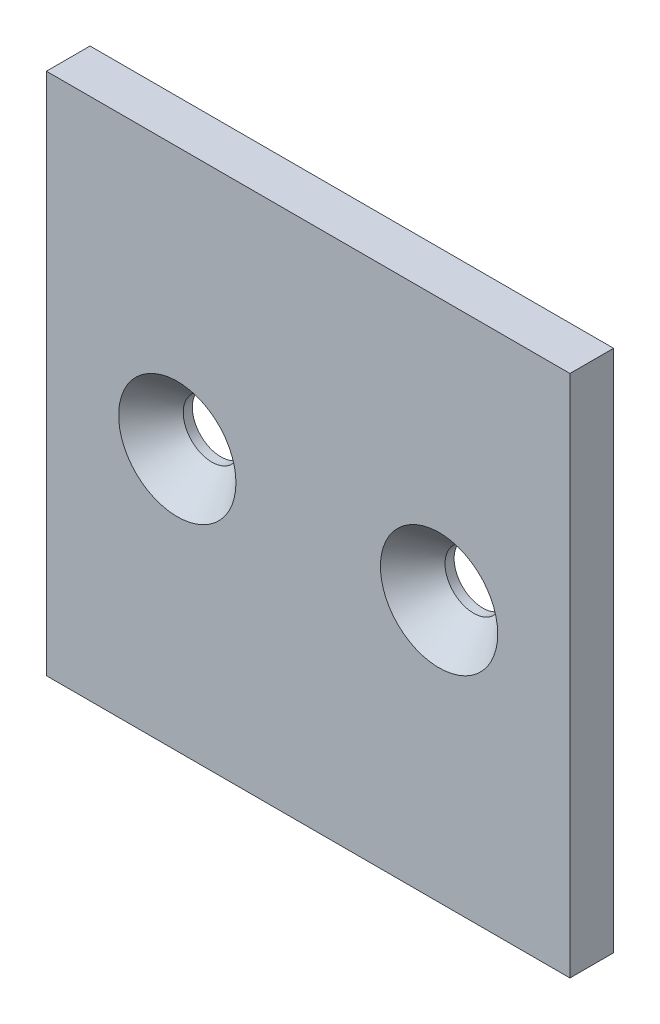
ISO-10303-21;
HEADER;
FILE_DESCRIPTION(('STEP AP214'),'2;1');
FILE_NAME('part.step','',(''),(''),'','','');
FILE_SCHEMA(('AUTOMOTIVE_DESIGN { 1 0 10303 214 1 1 1 1 }'));
ENDSEC;
DATA;
#1=APPLICATION_CONTEXT('core data for automotive mechanical design processes');
#2=APPLICATION_PROTOCOL_DEFINITION('international standard','automotive_design',2000,#1);
#3=PRODUCT_CONTEXT('',#1,'mechanical');
#4=PRODUCT('Part','Part','',(#3));
#5=PRODUCT_RELATED_PRODUCT_CATEGORY('part','',(#4));
#6=PRODUCT_DEFINITION_FORMATION('','',#4);
#7=PRODUCT_DEFINITION_CONTEXT('part definition',#1,'design');
#8=PRODUCT_DEFINITION('design','',#6,#7);
#9=PRODUCT_DEFINITION_SHAPE('','',#8);
#10=(LENGTH_UNIT() NAMED_UNIT(*) SI_UNIT(.MILLI.,.METRE.));
#11=(NAMED_UNIT(*) PLANE_ANGLE_UNIT() SI_UNIT($,.RADIAN.));
#12=(NAMED_UNIT(*) SI_UNIT($,.STERADIAN.) SOLID_ANGLE_UNIT());
#13=UNCERTAINTY_MEASURE_WITH_UNIT(LENGTH_MEASURE(1.E-05),#10,'distance_accuracy_value','');
#14=(GEOMETRIC_REPRESENTATION_CONTEXT(3) GLOBAL_UNCERTAINTY_ASSIGNED_CONTEXT((#13)) GLOBAL_UNIT_ASSIGNED_CONTEXT((#10,
#11,#12)) REPRESENTATION_CONTEXT('',''));
#15=CARTESIAN_POINT('',(0.,0.,0.));
#16=DIRECTION('',(0.,0.,1.));
#17=DIRECTION('',(1.,0.,0.));
#18=AXIS2_PLACEMENT_3D('',#15,#16,#17);
#19=CARTESIAN_POINT('',(0.,0.,3.175));
#20=DIRECTION('',(0.,0.,-1.));
#21=DIRECTION('',(-1.,0.,0.));
#22=AXIS2_PLACEMENT_3D('',#19,#20,#21);
#23=PLANE('',#22);
#24=CARTESIAN_POINT('',(19.05,38.1,3.175));
#25=DIRECTION('',(0.,0.,1.));
#26=DIRECTION('',(1.,0.,0.));
#27=AXIS2_PLACEMENT_3D('',#24,#25,#26);
#28=CIRCLE('',#27,8.53741686182538);
#29=CARTESIAN_POINT('',(27.5874168618254,38.1,3.175));
#30=VERTEX_POINT('',#29);
#31=EDGE_CURVE('E115',#30,#30,#28,.T.);
#32=ORIENTED_EDGE('',*,*,#31,.F.);
#33=EDGE_LOOP('',(#32));
#34=FACE_BOUND('',#33,.T.);
#35=DIRECTION('',(1.,0.,0.));
#36=VECTOR('',#35,1.);
#37=CARTESIAN_POINT('',(76.2,0.,3.175));
#38=LINE('',#37,#36);
#39=CARTESIAN_POINT('',(0.,0.,3.175));
#40=VERTEX_POINT('',#39);
#41=CARTESIAN_POINT('',(76.2,0.,3.175));
#42=VERTEX_POINT('',#41);
#43=EDGE_CURVE('E83',#40,#42,#38,.T.);
#44=ORIENTED_EDGE('',*,*,#43,.T.);
#45=DIRECTION('',(0.,1.,0.));
#46=VECTOR('',#45,1.);
#47=CARTESIAN_POINT('',(76.2,76.2,3.175));
#48=LINE('',#47,#46);
#49=CARTESIAN_POINT('',(76.2,76.2,3.175));
#50=VERTEX_POINT('',#49);
#51=EDGE_CURVE('E78',#42,#50,#48,.T.);
#52=ORIENTED_EDGE('',*,*,#51,.T.);
#53=DIRECTION('',(-1.,0.,0.));
#54=VECTOR('',#53,1.);
#55=CARTESIAN_POINT('',(76.2,76.2,3.175));
#56=LINE('',#55,#54);
#57=CARTESIAN_POINT('',(0.,76.2,3.175));
#58=VERTEX_POINT('',#57);
#59=EDGE_CURVE('E81',#50,#58,#56,.T.);
#60=ORIENTED_EDGE('',*,*,#59,.T.);
#61=DIRECTION('',(0.,-1.,0.));
#62=VECTOR('',#61,1.);
#63=CARTESIAN_POINT('',(0.,0.,3.175));
#64=LINE('',#63,#62);
#65=EDGE_CURVE('E48',#58,#40,#64,.T.);
#66=ORIENTED_EDGE('',*,*,#65,.T.);
#67=EDGE_LOOP('',(#44,#52,#60,#66));
#68=FACE_BOUND('',#67,.T.);
#69=CARTESIAN_POINT('',(57.15,38.1,3.175));
#70=DIRECTION('',(0.,0.,1.));
#71=DIRECTION('',(1.,0.,0.));
#72=AXIS2_PLACEMENT_3D('',#69,#70,#71);
#73=CIRCLE('',#72,8.53741686182538);
#74=CARTESIAN_POINT('',(65.6874168618254,38.1,3.175));
#75=VERTEX_POINT('',#74);
#76=EDGE_CURVE('E121',#75,#75,#73,.T.);
#77=ORIENTED_EDGE('',*,*,#76,.F.);
#78=EDGE_LOOP('',(#77));
#79=FACE_BOUND('',#78,.T.);
#80=ADVANCED_FACE('F31',(#34,#68,#79),#23,.F.);
#81=CARTESIAN_POINT('',(57.15,38.1,3.175));
#82=DIRECTION('',(0.,0.,-1.));
#83=DIRECTION('',(-1.,0.,0.));
#84=AXIS2_PLACEMENT_3D('',#81,#82,#83);
#85=CYLINDRICAL_SURFACE('',#84,4.1656);
#86=CARTESIAN_POINT('',(57.15,38.1,-3.175));
#87=DIRECTION('',(0.,0.,1.));
#88=DIRECTION('',(1.,0.,0.));
#89=AXIS2_PLACEMENT_3D('',#86,#87,#88);
#90=CIRCLE('',#89,4.1656);
#91=CARTESIAN_POINT('',(61.3156,38.1,-3.175));
#92=VERTEX_POINT('',#91);
#93=EDGE_CURVE('E112',#92,#92,#90,.T.);
#94=ORIENTED_EDGE('',*,*,#93,.F.);
#95=EDGE_LOOP('',(#94));
#96=FACE_BOUND('',#95,.T.);
#97=CARTESIAN_POINT('',(57.15,38.1,-1.8542));
#98=DIRECTION('',(0.,0.,1.));
#99=DIRECTION('',(1.,0.,0.));
#100=AXIS2_PLACEMENT_3D('',#97,#98,#99);
#101=CIRCLE('',#100,4.1656);
#102=CARTESIAN_POINT('',(61.3156,38.1,-1.8542));
#103=VERTEX_POINT('',#102);
#104=EDGE_CURVE('E124',#103,#103,#101,.T.);
#105=ORIENTED_EDGE('',*,*,#104,.T.);
#106=EDGE_LOOP('',(#105));
#107=FACE_BOUND('',#106,.T.);
#108=ADVANCED_FACE('F128',(#96,#107),#85,.F.);
#109=CARTESIAN_POINT('',(19.05,38.1,3.175));
#110=DIRECTION('',(0.,0.,-1.));
#111=DIRECTION('',(-1.,0.,0.));
#112=AXIS2_PLACEMENT_3D('',#109,#110,#111);
#113=CYLINDRICAL_SURFACE('',#112,4.1656);
#114=CARTESIAN_POINT('',(19.05,38.1,-3.175));
#115=DIRECTION('',(0.,0.,1.));
#116=DIRECTION('',(1.,0.,0.));
#117=AXIS2_PLACEMENT_3D('',#114,#115,#116);
#118=CIRCLE('',#117,4.1656);
#119=CARTESIAN_POINT('',(23.2156,38.1,-3.175));
#120=VERTEX_POINT('',#119);
#121=EDGE_CURVE('E98',#120,#120,#118,.T.);
#122=ORIENTED_EDGE('',*,*,#121,.F.);
#123=EDGE_LOOP('',(#122));
#124=FACE_BOUND('',#123,.T.);
#125=CARTESIAN_POINT('',(19.05,38.1,-1.8542));
#126=DIRECTION('',(0.,0.,1.));
#127=DIRECTION('',(1.,0.,0.));
#128=AXIS2_PLACEMENT_3D('',#125,#126,#127);
#129=CIRCLE('',#128,4.1656);
#130=CARTESIAN_POINT('',(23.2156,38.1,-1.8542));
#131=VERTEX_POINT('',#130);
#132=EDGE_CURVE('E118',#131,#131,#129,.T.);
#133=ORIENTED_EDGE('',*,*,#132,.T.);
#134=EDGE_LOOP('',(#133));
#135=FACE_BOUND('',#134,.T.);
#136=ADVANCED_FACE('F146',(#124,#135),#113,.F.);
#137=CARTESIAN_POINT('',(0.,0.,-3.175));
#138=DIRECTION('',(0.,0.,-1.));
#139=DIRECTION('',(-1.,0.,0.));
#140=AXIS2_PLACEMENT_3D('',#137,#138,#139);
#141=PLANE('',#140);
#142=ORIENTED_EDGE('',*,*,#121,.T.);
#143=EDGE_LOOP('',(#142));
#144=FACE_BOUND('',#143,.T.);
#145=DIRECTION('',(1.,0.,0.));
#146=VECTOR('',#145,1.);
#147=CARTESIAN_POINT('',(76.2,0.,-3.175));
#148=LINE('',#147,#146);
#149=CARTESIAN_POINT('',(0.,0.,-3.175));
#150=VERTEX_POINT('',#149);
#151=CARTESIAN_POINT('',(76.2,0.,-3.175));
#152=VERTEX_POINT('',#151);
#153=EDGE_CURVE('E95',#150,#152,#148,.T.);
#154=ORIENTED_EDGE('',*,*,#153,.F.);
#155=DIRECTION('',(0.,-1.,0.));
#156=VECTOR('',#155,1.);
#157=CARTESIAN_POINT('',(0.,0.,-3.175));
#158=LINE('',#157,#156);
#159=CARTESIAN_POINT('',(0.,76.2,-3.175));
#160=VERTEX_POINT('',#159);
#161=EDGE_CURVE('E71',#160,#150,#158,.T.);
#162=ORIENTED_EDGE('',*,*,#161,.F.);
#163=DIRECTION('',(-1.,0.,0.));
#164=VECTOR('',#163,1.);
#165=CARTESIAN_POINT('',(76.2,76.2,-3.175));
#166=LINE('',#165,#164);
#167=CARTESIAN_POINT('',(76.2,76.2,-3.175));
#168=VERTEX_POINT('',#167);
#169=EDGE_CURVE('E65',#168,#160,#166,.T.);
#170=ORIENTED_EDGE('',*,*,#169,.F.);
#171=DIRECTION('',(0.,1.,0.));
#172=VECTOR('',#171,1.);
#173=CARTESIAN_POINT('',(76.2,76.2,-3.175));
#174=LINE('',#173,#172);
#175=EDGE_CURVE('E87',#152,#168,#174,.T.);
#176=ORIENTED_EDGE('',*,*,#175,.F.);
#177=EDGE_LOOP('',(#154,#162,#170,#176));
#178=FACE_BOUND('',#177,.T.);
#179=ORIENTED_EDGE('',*,*,#93,.T.);
#180=EDGE_LOOP('',(#179));
#181=FACE_BOUND('',#180,.T.);
#182=ADVANCED_FACE('F106',(#144,#178,#181),#141,.T.);
#183=CARTESIAN_POINT('',(76.2,0.,3.175));
#184=DIRECTION('',(0.,1.,0.));
#185=DIRECTION('',(-1.,0.,0.));
#186=AXIS2_PLACEMENT_3D('',#183,#184,#185);
#187=PLANE('',#186);
#188=ORIENTED_EDGE('',*,*,#153,.T.);
#189=DIRECTION('',(0.,0.,-1.));
#190=VECTOR('',#189,1.);
#191=CARTESIAN_POINT('',(76.2,0.,3.175));
#192=LINE('',#191,#190);
#193=EDGE_CURVE('E11',#42,#152,#192,.T.);
#194=ORIENTED_EDGE('',*,*,#193,.F.);
#195=ORIENTED_EDGE('',*,*,#43,.F.);
#196=DIRECTION('',(0.,0.,-1.));
#197=VECTOR('',#196,1.);
#198=CARTESIAN_POINT('',(0.,0.,3.175));
#199=LINE('',#198,#197);
#200=EDGE_CURVE('E91',#40,#150,#199,.T.);
#201=ORIENTED_EDGE('',*,*,#200,.T.);
#202=EDGE_LOOP('',(#188,#194,#195,#201));
#203=FACE_BOUND('',#202,.T.);
#204=ADVANCED_FACE('F33',(#203),#187,.F.);
#205=CARTESIAN_POINT('',(76.2,76.2,3.175));
#206=DIRECTION('',(-1.,0.,0.));
#207=DIRECTION('',(0.,-1.,0.));
#208=AXIS2_PLACEMENT_3D('',#205,#206,#207);
#209=PLANE('',#208);
#210=ORIENTED_EDGE('',*,*,#175,.T.);
#211=DIRECTION('',(0.,0.,-1.));
#212=VECTOR('',#211,1.);
#213=CARTESIAN_POINT('',(76.2,76.2,3.175));
#214=LINE('',#213,#212);
#215=EDGE_CURVE('E40',#50,#168,#214,.T.);
#216=ORIENTED_EDGE('',*,*,#215,.F.);
#217=ORIENTED_EDGE('',*,*,#51,.F.);
#218=ORIENTED_EDGE('',*,*,#193,.T.);
#219=EDGE_LOOP('',(#210,#216,#217,#218));
#220=FACE_BOUND('',#219,.T.);
#221=ADVANCED_FACE('F86',(#220),#209,.F.);
#222=CARTESIAN_POINT('',(76.2,76.2,3.175));
#223=DIRECTION('',(0.,-1.,0.));
#224=DIRECTION('',(0.,0.,-1.));
#225=AXIS2_PLACEMENT_3D('',#222,#223,#224);
#226=PLANE('',#225);
#227=ORIENTED_EDGE('',*,*,#169,.T.);
#228=DIRECTION('',(0.,0.,-1.));
#229=VECTOR('',#228,1.);
#230=CARTESIAN_POINT('',(0.,76.2,3.175));
#231=LINE('',#230,#229);
#232=EDGE_CURVE('E88',#58,#160,#231,.T.);
#233=ORIENTED_EDGE('',*,*,#232,.F.);
#234=ORIENTED_EDGE('',*,*,#59,.F.);
#235=ORIENTED_EDGE('',*,*,#215,.T.);
#236=EDGE_LOOP('',(#227,#233,#234,#235));
#237=FACE_BOUND('',#236,.T.);
#238=ADVANCED_FACE('F89',(#237),#226,.F.);
#239=CARTESIAN_POINT('',(0.,0.,3.175));
#240=DIRECTION('',(1.,0.,0.));
#241=DIRECTION('',(0.,0.,-1.));
#242=AXIS2_PLACEMENT_3D('',#239,#240,#241);
#243=PLANE('',#242);
#244=ORIENTED_EDGE('',*,*,#161,.T.);
#245=ORIENTED_EDGE('',*,*,#200,.F.);
#246=ORIENTED_EDGE('',*,*,#65,.F.);
#247=ORIENTED_EDGE('',*,*,#232,.T.);
#248=EDGE_LOOP('',(#244,#245,#246,#247));
#249=FACE_BOUND('',#248,.T.);
#250=ADVANCED_FACE('F103',(#249),#243,.F.);
#251=CARTESIAN_POINT('',(19.05,38.1,-1.8542));
#252=DIRECTION('',(0.,0.,1.));
#253=DIRECTION('',(1.,0.,0.));
#254=AXIS2_PLACEMENT_3D('',#251,#252,#253);
#255=CONICAL_SURFACE('',#254,4.1656,0.715584993317677);
#256=ORIENTED_EDGE('',*,*,#31,.T.);
#257=EDGE_LOOP('',(#256));
#258=FACE_BOUND('',#257,.T.);
#259=ORIENTED_EDGE('',*,*,#132,.F.);
#260=EDGE_LOOP('',(#259));
#261=FACE_BOUND('',#260,.T.);
#262=ADVANCED_FACE('F132',(#258,#261),#255,.F.);
#263=CARTESIAN_POINT('',(57.15,38.1,-1.8542));
#264=DIRECTION('',(0.,0.,1.));
#265=DIRECTION('',(1.,0.,0.));
#266=AXIS2_PLACEMENT_3D('',#263,#264,#265);
#267=CONICAL_SURFACE('',#266,4.1656,0.715584993317677);
#268=ORIENTED_EDGE('',*,*,#76,.T.);
#269=EDGE_LOOP('',(#268));
#270=FACE_BOUND('',#269,.T.);
#271=ORIENTED_EDGE('',*,*,#104,.F.);
#272=EDGE_LOOP('',(#271));
#273=FACE_BOUND('',#272,.T.);
#274=ADVANCED_FACE('F130',(#270,#273),#267,.F.);
#275=CLOSED_SHELL('',(#80,#108,#136,#182,#204,#221,#238,#250,#262,#274));
#276=MANIFOLD_SOLID_BREP('B2',#275);
#277=ADVANCED_BREP_SHAPE_REPRESENTATION('',(#18,#276),#14);
#278=SHAPE_DEFINITION_REPRESENTATION(#9,#277);
ENDSEC;
END-ISO-10303-21;
